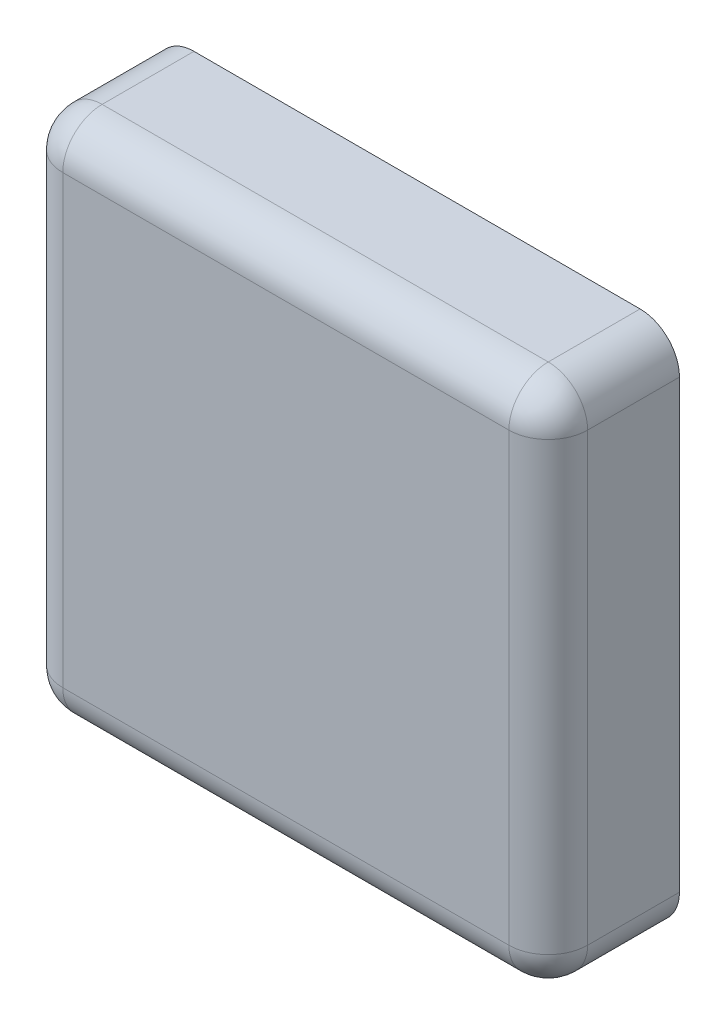
ISO-10303-21;
HEADER;
FILE_DESCRIPTION(('STEP AP214'),'2;1');
FILE_NAME('part.step','',(''),(''),'','','');
FILE_SCHEMA(('AUTOMOTIVE_DESIGN { 1 0 10303 214 1 1 1 1 }'));
ENDSEC;
DATA;
#1=APPLICATION_CONTEXT('core data for automotive mechanical design processes');
#2=APPLICATION_PROTOCOL_DEFINITION('international standard','automotive_design',2000,#1);
#3=PRODUCT_CONTEXT('',#1,'mechanical');
#4=PRODUCT('Part','Part','',(#3));
#5=PRODUCT_RELATED_PRODUCT_CATEGORY('part','',(#4));
#6=PRODUCT_DEFINITION_FORMATION('','',#4);
#7=PRODUCT_DEFINITION_CONTEXT('part definition',#1,'design');
#8=PRODUCT_DEFINITION('design','',#6,#7);
#9=PRODUCT_DEFINITION_SHAPE('','',#8);
#10=(LENGTH_UNIT() NAMED_UNIT(*) SI_UNIT(.MILLI.,.METRE.));
#11=(NAMED_UNIT(*) PLANE_ANGLE_UNIT() SI_UNIT($,.RADIAN.));
#12=(NAMED_UNIT(*) SI_UNIT($,.STERADIAN.) SOLID_ANGLE_UNIT());
#13=UNCERTAINTY_MEASURE_WITH_UNIT(LENGTH_MEASURE(1.E-05),#10,'distance_accuracy_value','');
#14=(GEOMETRIC_REPRESENTATION_CONTEXT(3) GLOBAL_UNCERTAINTY_ASSIGNED_CONTEXT((#13)) GLOBAL_UNIT_ASSIGNED_CONTEXT((#10,
#11,#12)) REPRESENTATION_CONTEXT('',''));
#15=CARTESIAN_POINT('',(0.,0.,0.));
#16=DIRECTION('',(0.,0.,1.));
#17=DIRECTION('',(1.,0.,0.));
#18=AXIS2_PLACEMENT_3D('',#15,#16,#17);
#19=CARTESIAN_POINT('',(0.,0.,5.));
#20=DIRECTION('',(-1.,0.,0.));
#21=DIRECTION('',(0.,0.,1.));
#22=AXIS2_PLACEMENT_3D('',#19,#20,#21);
#23=PLANE('',#22);
#24=DIRECTION('',(0.,1.,0.));
#25=VECTOR('',#24,1.);
#26=CARTESIAN_POINT('',(0.,0.,-5.));
#27=LINE('',#26,#25);
#28=CARTESIAN_POINT('',(0.,3.,-5.));
#29=VERTEX_POINT('',#28);
#30=CARTESIAN_POINT('',(0.,37.,-5.));
#31=VERTEX_POINT('',#30);
#32=EDGE_CURVE('E235',#29,#31,#27,.T.);
#33=ORIENTED_EDGE('',*,*,#32,.T.);
#34=DIRECTION('',(0.,0.,-1.));
#35=VECTOR('',#34,1.);
#36=CARTESIAN_POINT('',(0.,37.,5.));
#37=LINE('',#36,#35);
#38=CARTESIAN_POINT('',(0.,37.,2.));
#39=VERTEX_POINT('',#38);
#40=EDGE_CURVE('E57',#31,#39,#37,.F.);
#41=ORIENTED_EDGE('',*,*,#40,.T.);
#42=DIRECTION('',(0.,1.,0.));
#43=VECTOR('',#42,1.);
#44=CARTESIAN_POINT('',(0.,0.,2.));
#45=LINE('',#44,#43);
#46=CARTESIAN_POINT('',(0.,3.,2.));
#47=VERTEX_POINT('',#46);
#48=EDGE_CURVE('E62',#39,#47,#45,.F.);
#49=ORIENTED_EDGE('',*,*,#48,.T.);
#50=DIRECTION('',(0.,0.,-1.));
#51=VECTOR('',#50,1.);
#52=CARTESIAN_POINT('',(0.,3.,5.));
#53=LINE('',#52,#51);
#54=EDGE_CURVE('E188',#47,#29,#53,.T.);
#55=ORIENTED_EDGE('',*,*,#54,.T.);
#56=EDGE_LOOP('',(#33,#41,#49,#55));
#57=FACE_BOUND('',#56,.T.);
#58=ADVANCED_FACE('F39',(#57),#23,.F.);
#59=CARTESIAN_POINT('',(0.,40.,5.));
#60=DIRECTION('',(0.,-1.,0.));
#61=DIRECTION('',(1.,0.,0.));
#62=AXIS2_PLACEMENT_3D('',#59,#60,#61);
#63=PLANE('',#62);
#64=DIRECTION('',(-1.,0.,0.));
#65=VECTOR('',#64,1.);
#66=CARTESIAN_POINT('',(0.,40.,2.));
#67=LINE('',#66,#65);
#68=CARTESIAN_POINT('',(-37.,40.,2.));
#69=VERTEX_POINT('',#68);
#70=CARTESIAN_POINT('',(-3.,40.,2.));
#71=VERTEX_POINT('',#70);
#72=EDGE_CURVE('E182',#69,#71,#67,.F.);
#73=ORIENTED_EDGE('',*,*,#72,.T.);
#74=DIRECTION('',(0.,0.,-1.));
#75=VECTOR('',#74,1.);
#76=CARTESIAN_POINT('',(-3.,40.,5.));
#77=LINE('',#76,#75);
#78=CARTESIAN_POINT('',(-3.,40.,-5.));
#79=VERTEX_POINT('',#78);
#80=EDGE_CURVE('E185',#71,#79,#77,.T.);
#81=ORIENTED_EDGE('',*,*,#80,.T.);
#82=DIRECTION('',(-1.,0.,0.));
#83=VECTOR('',#82,1.);
#84=CARTESIAN_POINT('',(0.,40.,-5.));
#85=LINE('',#84,#83);
#86=CARTESIAN_POINT('',(-37.,40.,-5.));
#87=VERTEX_POINT('',#86);
#88=EDGE_CURVE('E238',#79,#87,#85,.T.);
#89=ORIENTED_EDGE('',*,*,#88,.T.);
#90=DIRECTION('',(0.,0.,-1.));
#91=VECTOR('',#90,1.);
#92=CARTESIAN_POINT('',(-37.,40.,5.));
#93=LINE('',#92,#91);
#94=EDGE_CURVE('E179',#87,#69,#93,.F.);
#95=ORIENTED_EDGE('',*,*,#94,.T.);
#96=EDGE_LOOP('',(#73,#81,#89,#95));
#97=FACE_BOUND('',#96,.T.);
#98=ADVANCED_FACE('F294',(#97),#63,.F.);
#99=CARTESIAN_POINT('',(-40.,0.,5.));
#100=DIRECTION('',(1.,0.,0.));
#101=DIRECTION('',(0.,0.,-1.));
#102=AXIS2_PLACEMENT_3D('',#99,#100,#101);
#103=PLANE('',#102);
#104=DIRECTION('',(0.,-1.,0.));
#105=VECTOR('',#104,1.);
#106=CARTESIAN_POINT('',(-40.,40.,2.));
#107=LINE('',#106,#105);
#108=CARTESIAN_POINT('',(-40.,3.,2.));
#109=VERTEX_POINT('',#108);
#110=CARTESIAN_POINT('',(-40.,37.,2.));
#111=VERTEX_POINT('',#110);
#112=EDGE_CURVE('E173',#109,#111,#107,.F.);
#113=ORIENTED_EDGE('',*,*,#112,.T.);
#114=DIRECTION('',(0.,0.,-1.));
#115=VECTOR('',#114,1.);
#116=CARTESIAN_POINT('',(-40.,37.,5.));
#117=LINE('',#116,#115);
#118=CARTESIAN_POINT('',(-40.,37.,-5.));
#119=VERTEX_POINT('',#118);
#120=EDGE_CURVE('E176',#111,#119,#117,.T.);
#121=ORIENTED_EDGE('',*,*,#120,.T.);
#122=DIRECTION('',(0.,-1.,0.));
#123=VECTOR('',#122,1.);
#124=CARTESIAN_POINT('',(-40.,0.,-5.));
#125=LINE('',#124,#123);
#126=CARTESIAN_POINT('',(-40.,3.,-5.));
#127=VERTEX_POINT('',#126);
#128=EDGE_CURVE('E243',#119,#127,#125,.T.);
#129=ORIENTED_EDGE('',*,*,#128,.T.);
#130=DIRECTION('',(0.,0.,-1.));
#131=VECTOR('',#130,1.);
#132=CARTESIAN_POINT('',(-40.,3.,5.));
#133=LINE('',#132,#131);
#134=EDGE_CURVE('E170',#127,#109,#133,.F.);
#135=ORIENTED_EDGE('',*,*,#134,.T.);
#136=EDGE_LOOP('',(#113,#121,#129,#135));
#137=FACE_BOUND('',#136,.T.);
#138=ADVANCED_FACE('F299',(#137),#103,.F.);
#139=CARTESIAN_POINT('',(0.,0.,5.));
#140=DIRECTION('',(0.,1.,0.));
#141=DIRECTION('',(0.,0.,1.));
#142=AXIS2_PLACEMENT_3D('',#139,#140,#141);
#143=PLANE('',#142);
#144=DIRECTION('',(1.,0.,0.));
#145=VECTOR('',#144,1.);
#146=CARTESIAN_POINT('',(-40.,0.,2.));
#147=LINE('',#146,#145);
#148=CARTESIAN_POINT('',(-3.,0.,2.));
#149=VERTEX_POINT('',#148);
#150=CARTESIAN_POINT('',(-37.,0.,2.));
#151=VERTEX_POINT('',#150);
#152=EDGE_CURVE('E125',#149,#151,#147,.F.);
#153=ORIENTED_EDGE('',*,*,#152,.T.);
#154=DIRECTION('',(0.,0.,-1.));
#155=VECTOR('',#154,1.);
#156=CARTESIAN_POINT('',(-37.,0.,5.));
#157=LINE('',#156,#155);
#158=CARTESIAN_POINT('',(-37.,0.,-5.));
#159=VERTEX_POINT('',#158);
#160=EDGE_CURVE('E167',#151,#159,#157,.T.);
#161=ORIENTED_EDGE('',*,*,#160,.T.);
#162=DIRECTION('',(1.,0.,0.));
#163=VECTOR('',#162,1.);
#164=CARTESIAN_POINT('',(0.,0.,-5.));
#165=LINE('',#164,#163);
#166=CARTESIAN_POINT('',(-3.,0.,-5.));
#167=VERTEX_POINT('',#166);
#168=EDGE_CURVE('E150',#159,#167,#165,.T.);
#169=ORIENTED_EDGE('',*,*,#168,.T.);
#170=DIRECTION('',(0.,0.,-1.));
#171=VECTOR('',#170,1.);
#172=CARTESIAN_POINT('',(-3.,0.,5.));
#173=LINE('',#172,#171);
#174=EDGE_CURVE('E157',#167,#149,#173,.F.);
#175=ORIENTED_EDGE('',*,*,#174,.T.);
#176=EDGE_LOOP('',(#153,#161,#169,#175));
#177=FACE_BOUND('',#176,.T.);
#178=ADVANCED_FACE('F271',(#177),#143,.F.);
#179=CARTESIAN_POINT('',(0.,0.,5.));
#180=DIRECTION('',(0.,0.,1.));
#181=DIRECTION('',(1.,0.,0.));
#182=AXIS2_PLACEMENT_3D('',#179,#180,#181);
#183=PLANE('',#182);
#184=DIRECTION('',(0.,-1.,0.));
#185=VECTOR('',#184,1.);
#186=CARTESIAN_POINT('',(-37.,0.,5.));
#187=LINE('',#186,#185);
#188=CARTESIAN_POINT('',(-37.,37.,5.));
#189=VERTEX_POINT('',#188);
#190=CARTESIAN_POINT('',(-37.,3.,5.));
#191=VERTEX_POINT('',#190);
#192=EDGE_CURVE('E154',#189,#191,#187,.T.);
#193=ORIENTED_EDGE('',*,*,#192,.T.);
#194=DIRECTION('',(1.,0.,0.));
#195=VECTOR('',#194,1.);
#196=CARTESIAN_POINT('',(0.,3.,5.));
#197=LINE('',#196,#195);
#198=CARTESIAN_POINT('',(-3.,3.,5.));
#199=VERTEX_POINT('',#198);
#200=EDGE_CURVE('E123',#191,#199,#197,.T.);
#201=ORIENTED_EDGE('',*,*,#200,.T.);
#202=DIRECTION('',(0.,1.,0.));
#203=VECTOR('',#202,1.);
#204=CARTESIAN_POINT('',(-3.,40.,5.));
#205=LINE('',#204,#203);
#206=CARTESIAN_POINT('',(-3.,37.,5.));
#207=VERTEX_POINT('',#206);
#208=EDGE_CURVE('E142',#199,#207,#205,.T.);
#209=ORIENTED_EDGE('',*,*,#208,.T.);
#210=DIRECTION('',(-1.,0.,0.));
#211=VECTOR('',#210,1.);
#212=CARTESIAN_POINT('',(-40.,37.,5.));
#213=LINE('',#212,#211);
#214=EDGE_CURVE('E149',#207,#189,#213,.T.);
#215=ORIENTED_EDGE('',*,*,#214,.T.);
#216=EDGE_LOOP('',(#193,#201,#209,#215));
#217=FACE_BOUND('',#216,.T.);
#218=ADVANCED_FACE('F152',(#217),#183,.T.);
#219=CARTESIAN_POINT('',(0.,0.,-5.));
#220=DIRECTION('',(0.,0.,1.));
#221=DIRECTION('',(1.,0.,0.));
#222=AXIS2_PLACEMENT_3D('',#219,#220,#221);
#223=PLANE('',#222);
#224=ORIENTED_EDGE('',*,*,#88,.F.);
#225=CARTESIAN_POINT('',(-3.,37.,-5.));
#226=DIRECTION('',(0.,0.,1.));
#227=DIRECTION('',(1.,0.,0.));
#228=AXIS2_PLACEMENT_3D('',#225,#226,#227);
#229=CIRCLE('',#228,3.);
#230=EDGE_CURVE('E11',#79,#31,#229,.F.);
#231=ORIENTED_EDGE('',*,*,#230,.T.);
#232=ORIENTED_EDGE('',*,*,#32,.F.);
#233=CARTESIAN_POINT('',(-3.,3.,-5.));
#234=DIRECTION('',(0.,0.,1.));
#235=DIRECTION('',(1.,0.,0.));
#236=AXIS2_PLACEMENT_3D('',#233,#234,#235);
#237=CIRCLE('',#236,3.);
#238=EDGE_CURVE('E195',#29,#167,#237,.F.);
#239=ORIENTED_EDGE('',*,*,#238,.T.);
#240=ORIENTED_EDGE('',*,*,#168,.F.);
#241=CARTESIAN_POINT('',(-37.,3.,-5.));
#242=DIRECTION('',(0.,0.,1.));
#243=DIRECTION('',(1.,0.,0.));
#244=AXIS2_PLACEMENT_3D('',#241,#242,#243);
#245=CIRCLE('',#244,3.);
#246=EDGE_CURVE('E198',#159,#127,#245,.F.);
#247=ORIENTED_EDGE('',*,*,#246,.T.);
#248=ORIENTED_EDGE('',*,*,#128,.F.);
#249=CARTESIAN_POINT('',(-37.,37.,-5.));
#250=DIRECTION('',(0.,0.,1.));
#251=DIRECTION('',(1.,0.,0.));
#252=AXIS2_PLACEMENT_3D('',#249,#250,#251);
#253=CIRCLE('',#252,3.);
#254=EDGE_CURVE('E49',#119,#87,#253,.F.);
#255=ORIENTED_EDGE('',*,*,#254,.T.);
#256=EDGE_LOOP('',(#224,#231,#232,#239,#240,#247,#248,#255));
#257=FACE_BOUND('',#256,.T.);
#258=ADVANCED_FACE('F278',(#257),#223,.F.);
#259=CARTESIAN_POINT('',(-37.,37.,5.));
#260=DIRECTION('',(0.,0.,-1.));
#261=DIRECTION('',(-1.,0.,0.));
#262=AXIS2_PLACEMENT_3D('',#259,#260,#261);
#263=CYLINDRICAL_SURFACE('',#262,3.);
#264=ORIENTED_EDGE('',*,*,#254,.F.);
#265=ORIENTED_EDGE('',*,*,#120,.F.);
#266=CARTESIAN_POINT('',(-37.,37.,2.));
#267=DIRECTION('',(0.,0.,1.));
#268=DIRECTION('',(1.,0.,0.));
#269=AXIS2_PLACEMENT_3D('',#266,#267,#268);
#270=CIRCLE('',#269,3.);
#271=EDGE_CURVE('E43',#69,#111,#270,.T.);
#272=ORIENTED_EDGE('',*,*,#271,.F.);
#273=ORIENTED_EDGE('',*,*,#94,.F.);
#274=EDGE_LOOP('',(#264,#265,#272,#273));
#275=FACE_BOUND('',#274,.T.);
#276=ADVANCED_FACE('F41',(#275),#263,.T.);
#277=CARTESIAN_POINT('',(0.,37.,2.));
#278=DIRECTION('',(1.,0.,0.));
#279=DIRECTION('',(0.,1.,0.));
#280=AXIS2_PLACEMENT_3D('',#277,#278,#279);
#281=CYLINDRICAL_SURFACE('',#280,3.);
#282=CARTESIAN_POINT('',(-3.,37.,2.));
#283=DIRECTION('',(1.,0.,0.));
#284=DIRECTION('',(0.,1.,0.));
#285=AXIS2_PLACEMENT_3D('',#282,#283,#284);
#286=CIRCLE('',#285,3.);
#287=EDGE_CURVE('E224',#71,#207,#286,.T.);
#288=ORIENTED_EDGE('',*,*,#287,.F.);
#289=ORIENTED_EDGE('',*,*,#72,.F.);
#290=CARTESIAN_POINT('',(-37.,37.,2.));
#291=DIRECTION('',(-1.,0.,0.));
#292=DIRECTION('',(0.,0.,1.));
#293=AXIS2_PLACEMENT_3D('',#290,#291,#292);
#294=CIRCLE('',#293,3.);
#295=EDGE_CURVE('E227',#189,#69,#294,.T.);
#296=ORIENTED_EDGE('',*,*,#295,.F.);
#297=ORIENTED_EDGE('',*,*,#214,.F.);
#298=EDGE_LOOP('',(#288,#289,#296,#297));
#299=FACE_BOUND('',#298,.T.);
#300=ADVANCED_FACE('F255',(#299),#281,.T.);
#301=CARTESIAN_POINT('',(-3.,37.,5.));
#302=DIRECTION('',(0.,0.,-1.));
#303=DIRECTION('',(-1.,0.,0.));
#304=AXIS2_PLACEMENT_3D('',#301,#302,#303);
#305=CYLINDRICAL_SURFACE('',#304,3.);
#306=ORIENTED_EDGE('',*,*,#230,.F.);
#307=ORIENTED_EDGE('',*,*,#80,.F.);
#308=CARTESIAN_POINT('',(-3.,37.,2.));
#309=DIRECTION('',(0.,0.,1.));
#310=DIRECTION('',(1.,0.,0.));
#311=AXIS2_PLACEMENT_3D('',#308,#309,#310);
#312=CIRCLE('',#311,3.);
#313=EDGE_CURVE('E220',#39,#71,#312,.T.);
#314=ORIENTED_EDGE('',*,*,#313,.F.);
#315=ORIENTED_EDGE('',*,*,#40,.F.);
#316=EDGE_LOOP('',(#306,#307,#314,#315));
#317=FACE_BOUND('',#316,.T.);
#318=ADVANCED_FACE('F282',(#317),#305,.T.);
#319=CARTESIAN_POINT('',(-37.,37.,2.));
#320=DIRECTION('',(0.,0.,1.));
#321=DIRECTION('',(1.,0.,0.));
#322=AXIS2_PLACEMENT_3D('',#319,#320,#321);
#323=SPHERICAL_SURFACE('',#322,3.);
#324=ORIENTED_EDGE('',*,*,#295,.T.);
#325=ORIENTED_EDGE('',*,*,#271,.T.);
#326=CARTESIAN_POINT('',(-37.,37.,2.));
#327=DIRECTION('',(0.,1.,0.));
#328=DIRECTION('',(0.,0.,1.));
#329=AXIS2_PLACEMENT_3D('',#326,#327,#328);
#330=CIRCLE('',#329,3.);
#331=EDGE_CURVE('E216',#189,#111,#330,.F.);
#332=ORIENTED_EDGE('',*,*,#331,.F.);
#333=EDGE_LOOP('',(#324,#325,#332));
#334=FACE_BOUND('',#333,.T.);
#335=ADVANCED_FACE('F256',(#334),#323,.T.);
#336=CARTESIAN_POINT('',(-3.,37.,2.));
#337=DIRECTION('',(0.,0.,1.));
#338=DIRECTION('',(1.,0.,0.));
#339=AXIS2_PLACEMENT_3D('',#336,#337,#338);
#340=SPHERICAL_SURFACE('',#339,3.);
#341=ORIENTED_EDGE('',*,*,#313,.T.);
#342=ORIENTED_EDGE('',*,*,#287,.T.);
#343=CARTESIAN_POINT('',(-3.,37.,2.));
#344=DIRECTION('',(0.,1.,0.));
#345=DIRECTION('',(0.,0.,1.));
#346=AXIS2_PLACEMENT_3D('',#343,#344,#345);
#347=CIRCLE('',#346,3.);
#348=EDGE_CURVE('E145',#39,#207,#347,.F.);
#349=ORIENTED_EDGE('',*,*,#348,.F.);
#350=EDGE_LOOP('',(#341,#342,#349));
#351=FACE_BOUND('',#350,.T.);
#352=ADVANCED_FACE('F284',(#351),#340,.T.);
#353=CARTESIAN_POINT('',(-37.,3.,5.));
#354=DIRECTION('',(0.,0.,-1.));
#355=DIRECTION('',(-1.,0.,0.));
#356=AXIS2_PLACEMENT_3D('',#353,#354,#355);
#357=CYLINDRICAL_SURFACE('',#356,3.);
#358=ORIENTED_EDGE('',*,*,#246,.F.);
#359=ORIENTED_EDGE('',*,*,#160,.F.);
#360=CARTESIAN_POINT('',(-37.,3.,2.));
#361=DIRECTION('',(0.,0.,1.));
#362=DIRECTION('',(1.,0.,0.));
#363=AXIS2_PLACEMENT_3D('',#360,#361,#362);
#364=CIRCLE('',#363,3.);
#365=EDGE_CURVE('E210',#109,#151,#364,.T.);
#366=ORIENTED_EDGE('',*,*,#365,.F.);
#367=ORIENTED_EDGE('',*,*,#134,.F.);
#368=EDGE_LOOP('',(#358,#359,#366,#367));
#369=FACE_BOUND('',#368,.T.);
#370=ADVANCED_FACE('F268',(#369),#357,.T.);
#371=CARTESIAN_POINT('',(-37.,0.,2.));
#372=DIRECTION('',(0.,1.,0.));
#373=DIRECTION('',(0.,0.,1.));
#374=AXIS2_PLACEMENT_3D('',#371,#372,#373);
#375=CYLINDRICAL_SURFACE('',#374,3.);
#376=ORIENTED_EDGE('',*,*,#331,.T.);
#377=ORIENTED_EDGE('',*,*,#112,.F.);
#378=CARTESIAN_POINT('',(-37.,3.,2.));
#379=DIRECTION('',(0.,-1.,0.));
#380=DIRECTION('',(0.,0.,-1.));
#381=AXIS2_PLACEMENT_3D('',#378,#379,#380);
#382=CIRCLE('',#381,3.);
#383=EDGE_CURVE('E139',#191,#109,#382,.T.);
#384=ORIENTED_EDGE('',*,*,#383,.F.);
#385=ORIENTED_EDGE('',*,*,#192,.F.);
#386=EDGE_LOOP('',(#376,#377,#384,#385));
#387=FACE_BOUND('',#386,.T.);
#388=ADVANCED_FACE('F259',(#387),#375,.T.);
#389=CARTESIAN_POINT('',(-3.,0.,2.));
#390=DIRECTION('',(0.,-1.,0.));
#391=DIRECTION('',(0.,0.,-1.));
#392=AXIS2_PLACEMENT_3D('',#389,#390,#391);
#393=CYLINDRICAL_SURFACE('',#392,3.);
#394=ORIENTED_EDGE('',*,*,#348,.T.);
#395=ORIENTED_EDGE('',*,*,#208,.F.);
#396=CARTESIAN_POINT('',(-3.,3.,2.));
#397=DIRECTION('',(0.,-1.,0.));
#398=DIRECTION('',(0.,0.,-1.));
#399=AXIS2_PLACEMENT_3D('',#396,#397,#398);
#400=CIRCLE('',#399,3.);
#401=EDGE_CURVE('E132',#47,#199,#400,.T.);
#402=ORIENTED_EDGE('',*,*,#401,.F.);
#403=ORIENTED_EDGE('',*,*,#48,.F.);
#404=EDGE_LOOP('',(#394,#395,#402,#403));
#405=FACE_BOUND('',#404,.T.);
#406=ADVANCED_FACE('F143',(#405),#393,.T.);
#407=CARTESIAN_POINT('',(-3.,3.,5.));
#408=DIRECTION('',(0.,0.,-1.));
#409=DIRECTION('',(-1.,0.,0.));
#410=AXIS2_PLACEMENT_3D('',#407,#408,#409);
#411=CYLINDRICAL_SURFACE('',#410,3.);
#412=ORIENTED_EDGE('',*,*,#238,.F.);
#413=ORIENTED_EDGE('',*,*,#54,.F.);
#414=CARTESIAN_POINT('',(-3.,3.,2.));
#415=DIRECTION('',(0.,0.,1.));
#416=DIRECTION('',(1.,0.,0.));
#417=AXIS2_PLACEMENT_3D('',#414,#415,#416);
#418=CIRCLE('',#417,3.);
#419=EDGE_CURVE('E136',#149,#47,#418,.T.);
#420=ORIENTED_EDGE('',*,*,#419,.F.);
#421=ORIENTED_EDGE('',*,*,#174,.F.);
#422=EDGE_LOOP('',(#412,#413,#420,#421));
#423=FACE_BOUND('',#422,.T.);
#424=ADVANCED_FACE('F275',(#423),#411,.T.);
#425=CARTESIAN_POINT('',(-37.,3.,2.));
#426=DIRECTION('',(0.,0.,1.));
#427=DIRECTION('',(1.,0.,0.));
#428=AXIS2_PLACEMENT_3D('',#425,#426,#427);
#429=SPHERICAL_SURFACE('',#428,3.);
#430=ORIENTED_EDGE('',*,*,#383,.T.);
#431=ORIENTED_EDGE('',*,*,#365,.T.);
#432=CARTESIAN_POINT('',(-37.,3.,2.));
#433=DIRECTION('',(-1.,0.,0.));
#434=DIRECTION('',(0.,0.,1.));
#435=AXIS2_PLACEMENT_3D('',#432,#433,#434);
#436=CIRCLE('',#435,3.);
#437=EDGE_CURVE('E129',#191,#151,#436,.F.);
#438=ORIENTED_EDGE('',*,*,#437,.F.);
#439=EDGE_LOOP('',(#430,#431,#438));
#440=FACE_BOUND('',#439,.T.);
#441=ADVANCED_FACE('F263',(#440),#429,.T.);
#442=CARTESIAN_POINT('',(-3.,3.,2.));
#443=DIRECTION('',(0.,0.,1.));
#444=DIRECTION('',(1.,0.,0.));
#445=AXIS2_PLACEMENT_3D('',#442,#443,#444);
#446=SPHERICAL_SURFACE('',#445,3.);
#447=ORIENTED_EDGE('',*,*,#419,.T.);
#448=ORIENTED_EDGE('',*,*,#401,.T.);
#449=CARTESIAN_POINT('',(-3.,3.,2.));
#450=DIRECTION('',(1.,0.,0.));
#451=DIRECTION('',(0.,0.,-1.));
#452=AXIS2_PLACEMENT_3D('',#449,#450,#451);
#453=CIRCLE('',#452,3.);
#454=EDGE_CURVE('E119',#149,#199,#453,.F.);
#455=ORIENTED_EDGE('',*,*,#454,.F.);
#456=EDGE_LOOP('',(#447,#448,#455));
#457=FACE_BOUND('',#456,.T.);
#458=ADVANCED_FACE('F134',(#457),#446,.T.);
#459=CARTESIAN_POINT('',(0.,3.,2.));
#460=DIRECTION('',(-1.,0.,0.));
#461=DIRECTION('',(0.,0.,1.));
#462=AXIS2_PLACEMENT_3D('',#459,#460,#461);
#463=CYLINDRICAL_SURFACE('',#462,3.);
#464=ORIENTED_EDGE('',*,*,#437,.T.);
#465=ORIENTED_EDGE('',*,*,#152,.F.);
#466=ORIENTED_EDGE('',*,*,#454,.T.);
#467=ORIENTED_EDGE('',*,*,#200,.F.);
#468=EDGE_LOOP('',(#464,#465,#466,#467));
#469=FACE_BOUND('',#468,.T.);
#470=ADVANCED_FACE('F121',(#469),#463,.T.);
#471=CLOSED_SHELL('',(#58,#98,#138,#178,#218,#258,#276,#300,#318,#335,#352,#370,#388,#406,#424,
#441,#458,#470));
#472=MANIFOLD_SOLID_BREP('B2',#471);
#473=ADVANCED_BREP_SHAPE_REPRESENTATION('',(#18,#472),#14);
#474=SHAPE_DEFINITION_REPRESENTATION(#9,#473);
ENDSEC;
END-ISO-10303-21;
